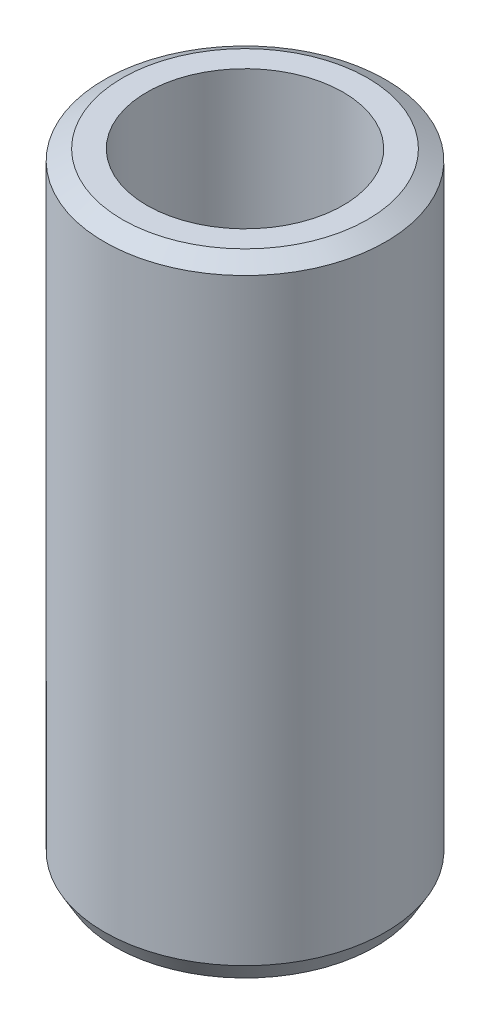
ISO-10303-21;
HEADER;
FILE_DESCRIPTION(('STEP AP214'),'2;1');
FILE_NAME('part.step','',(''),(''),'','','');
FILE_SCHEMA(('AUTOMOTIVE_DESIGN { 1 0 10303 214 1 1 1 1 }'));
ENDSEC;
DATA;
#1=APPLICATION_CONTEXT('core data for automotive mechanical design processes');
#2=APPLICATION_PROTOCOL_DEFINITION('international standard','automotive_design',2000,#1);
#3=PRODUCT_CONTEXT('',#1,'mechanical');
#4=PRODUCT('Part','Part','',(#3));
#5=PRODUCT_RELATED_PRODUCT_CATEGORY('part','',(#4));
#6=PRODUCT_DEFINITION_FORMATION('','',#4);
#7=PRODUCT_DEFINITION_CONTEXT('part definition',#1,'design');
#8=PRODUCT_DEFINITION('design','',#6,#7);
#9=PRODUCT_DEFINITION_SHAPE('','',#8);
#10=(LENGTH_UNIT() NAMED_UNIT(*) SI_UNIT(.MILLI.,.METRE.));
#11=(NAMED_UNIT(*) PLANE_ANGLE_UNIT() SI_UNIT($,.RADIAN.));
#12=(NAMED_UNIT(*) SI_UNIT($,.STERADIAN.) SOLID_ANGLE_UNIT());
#13=UNCERTAINTY_MEASURE_WITH_UNIT(LENGTH_MEASURE(1.E-05),#10,'distance_accuracy_value','');
#14=(GEOMETRIC_REPRESENTATION_CONTEXT(3) GLOBAL_UNCERTAINTY_ASSIGNED_CONTEXT((#13)) GLOBAL_UNIT_ASSIGNED_CONTEXT((#10,
#11,#12)) REPRESENTATION_CONTEXT('',''));
#15=CARTESIAN_POINT('',(0.,0.,0.));
#16=DIRECTION('',(0.,0.,1.));
#17=DIRECTION('',(1.,0.,0.));
#18=AXIS2_PLACEMENT_3D('',#15,#16,#17);
#19=CARTESIAN_POINT('',(0.,244.865349335781,0.));
#20=DIRECTION('',(0.,-1.,0.));
#21=DIRECTION('',(0.,0.,-1.));
#22=AXIS2_PLACEMENT_3D('',#19,#20,#21);
#23=CYLINDRICAL_SURFACE('',#22,55.);
#24=CARTESIAN_POINT('',(0.,240.804430638492,0.));
#25=DIRECTION('',(0.,1.,0.));
#26=DIRECTION('',(0.,0.,1.));
#27=AXIS2_PLACEMENT_3D('',#24,#25,#26);
#28=CIRCLE('',#27,55.);
#29=CARTESIAN_POINT('',(0.,240.804430638492,-55.));
#30=VERTEX_POINT('',#29);
#31=EDGE_CURVE('E50',#30,#30,#28,.F.);
#32=CARTESIAN_POINT('',(0.,7.03371750911244,0.));
#33=DIRECTION('',(0.,1.,0.));
#34=DIRECTION('',(0.,0.,1.));
#35=AXIS2_PLACEMENT_3D('',#32,#33,#34);
#36=CIRCLE('',#35,55.);
#37=CARTESIAN_POINT('',(0.,7.03371750911241,-55.));
#38=VERTEX_POINT('',#37);
#39=EDGE_CURVE('E51',#38,#38,#36,.T.);
#40=CARTESIAN_POINT('',(0.,240.804430638492,-55.));
#41=CARTESIAN_POINT('',(0.,238.369319043394,-55.));
#42=CARTESIAN_POINT('',(0.,235.934207448296,-55.));
#43=CARTESIAN_POINT('',(0.,231.063984258101,-55.));
#44=CARTESIAN_POINT('',(0.,228.628872663003,-55.));
#45=CARTESIAN_POINT('',(0.,223.758649472808,-55.));
#46=CARTESIAN_POINT('',(0.,221.32353787771,-55.));
#47=CARTESIAN_POINT('',(0.,216.453314687515,-55.));
#48=CARTESIAN_POINT('',(0.,214.018203092417,-55.));
#49=CARTESIAN_POINT('',(0.,209.147979902221,-55.));
#50=CARTESIAN_POINT('',(0.,206.712868307124,-55.));
#51=CARTESIAN_POINT('',(0.,201.842645116928,-55.));
#52=CARTESIAN_POINT('',(0.,199.407533521831,-55.));
#53=CARTESIAN_POINT('',(0.,194.537310331635,-55.));
#54=CARTESIAN_POINT('',(0.,192.102198736538,-55.));
#55=CARTESIAN_POINT('',(0.,187.231975546342,-55.));
#56=CARTESIAN_POINT('',(0.,184.796863951244,-55.));
#57=CARTESIAN_POINT('',(0.,179.926640761049,-55.));
#58=CARTESIAN_POINT('',(0.,177.491529165951,-55.));
#59=CARTESIAN_POINT('',(0.,172.621305975756,-55.));
#60=CARTESIAN_POINT('',(0.,170.186194380658,-55.));
#61=CARTESIAN_POINT('',(0.,165.315971190463,-55.));
#62=CARTESIAN_POINT('',(0.,162.880859595365,-55.));
#63=CARTESIAN_POINT('',(0.,158.01063640517,-55.));
#64=CARTESIAN_POINT('',(0.,155.575524810072,-55.));
#65=CARTESIAN_POINT('',(0.,150.705301619877,-55.));
#66=CARTESIAN_POINT('',(0.,148.270190024779,-55.));
#67=CARTESIAN_POINT('',(0.,143.399966834584,-55.));
#68=CARTESIAN_POINT('',(0.,140.964855239486,-55.));
#69=CARTESIAN_POINT('',(0.,136.09463204929,-55.));
#70=CARTESIAN_POINT('',(0.,133.659520454193,-55.));
#71=CARTESIAN_POINT('',(0.,128.789297263997,-55.));
#72=CARTESIAN_POINT('',(0.,126.3541856689,-55.));
#73=CARTESIAN_POINT('',(0.,121.483962478704,-55.));
#74=CARTESIAN_POINT('',(0.,119.048850883607,-55.));
#75=CARTESIAN_POINT('',(0.,114.178627693411,-55.));
#76=CARTESIAN_POINT('',(0.,111.743516098313,-55.));
#77=CARTESIAN_POINT('',(0.,106.873292908118,-55.));
#78=CARTESIAN_POINT('',(0.,104.43818131302,-55.));
#79=CARTESIAN_POINT('',(0.,99.567958122825,-55.));
#80=CARTESIAN_POINT('',(0.,97.1328465277273,-55.));
#81=CARTESIAN_POINT('',(0.,92.2626233375319,-55.));
#82=CARTESIAN_POINT('',(0.,89.8275117424342,-55.));
#83=CARTESIAN_POINT('',(0.,84.9572885522388,-55.));
#84=CARTESIAN_POINT('',(0.,82.5221769571411,-55.));
#85=CARTESIAN_POINT('',(0.,77.6519537669457,-55.));
#86=CARTESIAN_POINT('',(0.,75.216842171848,-55.));
#87=CARTESIAN_POINT('',(0.,70.3466189816526,-55.));
#88=CARTESIAN_POINT('',(0.,67.9115073865549,-55.));
#89=CARTESIAN_POINT('',(0.,63.0412841963595,-55.));
#90=CARTESIAN_POINT('',(0.,60.6061726012618,-55.));
#91=CARTESIAN_POINT('',(0.,55.7359494110664,-55.));
#92=CARTESIAN_POINT('',(0.,53.3008378159687,-55.));
#93=CARTESIAN_POINT('',(0.,48.4306146257733,-55.));
#94=CARTESIAN_POINT('',(0.,45.9955030306756,-55.));
#95=CARTESIAN_POINT('',(0.,41.1252798404802,-55.));
#96=CARTESIAN_POINT('',(0.,38.6901682453825,-55.));
#97=CARTESIAN_POINT('',(0.,33.8199450551871,-55.));
#98=CARTESIAN_POINT('',(0.,31.3848334600894,-55.));
#99=CARTESIAN_POINT('',(0.,26.514610269894,-55.));
#100=CARTESIAN_POINT('',(0.,24.0794986747963,-55.));
#101=CARTESIAN_POINT('',(0.,19.2092754846009,-55.));
#102=CARTESIAN_POINT('',(0.,16.7741638895032,-55.));
#103=CARTESIAN_POINT('',(0.,11.9039406993078,-55.));
#104=CARTESIAN_POINT('',(0.,9.46882910421011,-55.));
#105=CARTESIAN_POINT('',(0.,7.03371750911241,-55.));
#106=B_SPLINE_CURVE_WITH_KNOTS('',3,(#40,#41,#42,#43,#44,#45,#46,#47,#48,#49,#50,#51,#52,#53,
#54,#55,#56,#57,#58,#59,#60,#61,#62,#63,#64,#65,#66,#67,#68,#69,#70,#71,#72,#73,#74,#75,#76,#77,
#78,#79,#80,#81,#82,#83,#84,#85,#86,#87,#88,#89,#90,#91,#92,#93,#94,#95,#96,#97,#98,#99,#100,
#101,#102,#103,#104,#105),.UNSPECIFIED.,.F.,.F.,(4,2,2,2,2,2,2,2,2,2,2,2,2,2,2,2,2,2,2,2,2,2,2,
2,2,2,2,2,2,2,2,2,4),(0.,7.30533478529311,14.6106695705862,21.9160043558793,29.2213391411724,
36.5266739264655,43.8320087117586,51.1373434970517,58.4426782823448,65.7480130676379,
73.053347852931,80.3586826382241,87.6640174235172,94.9693522088103,102.274686994103,
109.580021779396,116.88535656469,124.190691349983,131.496026135276,138.801360920569,
146.106695705862,153.412030491155,160.717365276448,168.022700061741,175.328034847034,
182.633369632327,189.938704417621,197.244039202914,204.549373988207,211.8547087735,
219.160043558793,226.465378344086,233.770713129379),.UNSPECIFIED.);
#107=EDGE_CURVE('BSEAM39',#30,#38,#106,.T.);
#108=ORIENTED_EDGE('',*,*,#31,.T.);
#109=ORIENTED_EDGE('',*,*,#39,.T.);
#110=ORIENTED_EDGE('',*,*,#107,.T.);
#111=ORIENTED_EDGE('',*,*,#107,.F.);
#112=EDGE_LOOP('',(#108,#110,#109,#111));
#113=FACE_BOUND('',#112,.T.);
#114=ADVANCED_FACE('F39',(#113),#23,.T.);
#115=CARTESIAN_POINT('',(0.,244.865349335781,0.));
#116=DIRECTION('',(0.,1.,0.));
#117=DIRECTION('',(0.,0.,1.));
#118=AXIS2_PLACEMENT_3D('',#115,#116,#117);
#119=PLANE('',#118);
#120=CARTESIAN_POINT('',(0.,244.865349335781,0.));
#121=DIRECTION('',(0.,1.,0.));
#122=DIRECTION('',(0.,0.,1.));
#123=AXIS2_PLACEMENT_3D('',#120,#121,#122);
#124=CIRCLE('',#123,47.9662824908881);
#125=CARTESIAN_POINT('',(0.,244.865349335781,47.9662824908881));
#126=VERTEX_POINT('',#125);
#127=EDGE_CURVE('E54',#126,#126,#124,.T.);
#128=ORIENTED_EDGE('',*,*,#127,.T.);
#129=EDGE_LOOP('',(#128));
#130=FACE_BOUND('',#129,.T.);
#131=CARTESIAN_POINT('',(0.,244.865349335781,0.));
#132=DIRECTION('',(0.,1.,0.));
#133=DIRECTION('',(0.,0.,1.));
#134=AXIS2_PLACEMENT_3D('',#131,#132,#133);
#135=CIRCLE('',#134,38.3685747780676);
#136=CARTESIAN_POINT('',(0.,244.865349335781,-38.3685747780676));
#137=VERTEX_POINT('',#136);
#138=EDGE_CURVE('E58',#137,#137,#135,.T.);
#139=ORIENTED_EDGE('',*,*,#138,.F.);
#140=EDGE_LOOP('',(#139));
#141=FACE_BOUND('',#140,.T.);
#142=ADVANCED_FACE('F69',(#130,#141),#119,.T.);
#143=CARTESIAN_POINT('',(0.,0.,0.));
#144=DIRECTION('',(0.,1.,0.));
#145=DIRECTION('',(0.,0.,1.));
#146=AXIS2_PLACEMENT_3D('',#143,#144,#145);
#147=PLANE('',#146);
#148=CARTESIAN_POINT('',(0.,0.,0.));
#149=DIRECTION('',(0.,1.,0.));
#150=DIRECTION('',(0.,0.,1.));
#151=AXIS2_PLACEMENT_3D('',#148,#149,#150);
#152=CIRCLE('',#151,50.9390813027101);
#153=CARTESIAN_POINT('',(0.,0.,50.9390813027101));
#154=VERTEX_POINT('',#153);
#155=EDGE_CURVE('E10',#154,#154,#152,.F.);
#156=ORIENTED_EDGE('',*,*,#155,.T.);
#157=EDGE_LOOP('',(#156));
#158=FACE_BOUND('',#157,.T.);
#159=CARTESIAN_POINT('',(0.,0.,0.));
#160=DIRECTION('',(0.,1.,0.));
#161=DIRECTION('',(0.,0.,1.));
#162=AXIS2_PLACEMENT_3D('',#159,#160,#161);
#163=CIRCLE('',#162,38.3685747780676);
#164=CARTESIAN_POINT('',(0.,0.,-38.3685747780676));
#165=VERTEX_POINT('',#164);
#166=EDGE_CURVE('E63',#165,#165,#163,.T.);
#167=ORIENTED_EDGE('',*,*,#166,.T.);
#168=EDGE_LOOP('',(#167));
#169=FACE_BOUND('',#168,.T.);
#170=ADVANCED_FACE('F75',(#158,#169),#147,.F.);
#171=CARTESIAN_POINT('',(0.,244.865349335781,0.));
#172=DIRECTION('',(0.,-1.,0.));
#173=DIRECTION('',(0.,0.,-1.));
#174=AXIS2_PLACEMENT_3D('',#171,#172,#173);
#175=CYLINDRICAL_SURFACE('',#174,38.3685747780676);
#176=CARTESIAN_POINT('',(0.,244.865349335781,-38.3685747780676));
#177=CARTESIAN_POINT('',(0.,242.314668613533,-38.3685747780676));
#178=CARTESIAN_POINT('',(0.,239.763987891286,-38.3685747780676));
#179=CARTESIAN_POINT('',(0.,234.66262644679,-38.3685747780676));
#180=CARTESIAN_POINT('',(0.,232.111945724542,-38.3685747780676));
#181=CARTESIAN_POINT('',(0.,227.010584280047,-38.3685747780676));
#182=CARTESIAN_POINT('',(0.,224.459903557799,-38.3685747780676));
#183=CARTESIAN_POINT('',(0.,219.358542113304,-38.3685747780676));
#184=CARTESIAN_POINT('',(0.,216.807861391056,-38.3685747780676));
#185=CARTESIAN_POINT('',(0.,211.706499946561,-38.3685747780676));
#186=CARTESIAN_POINT('',(0.,209.155819224313,-38.3685747780676));
#187=CARTESIAN_POINT('',(0.,204.054457779818,-38.3685747780676));
#188=CARTESIAN_POINT('',(0.,201.50377705757,-38.3685747780676));
#189=CARTESIAN_POINT('',(0.,196.402415613074,-38.3685747780676));
#190=CARTESIAN_POINT('',(0.,193.851734890827,-38.3685747780676));
#191=CARTESIAN_POINT('',(0.,188.750373446331,-38.3685747780676));
#192=CARTESIAN_POINT('',(0.,186.199692724083,-38.3685747780676));
#193=CARTESIAN_POINT('',(0.,181.098331279588,-38.3685747780676));
#194=CARTESIAN_POINT('',(0.,178.54765055734,-38.3685747780676));
#195=CARTESIAN_POINT('',(0.,173.446289112845,-38.3685747780676));
#196=CARTESIAN_POINT('',(0.,170.895608390597,-38.3685747780676));
#197=CARTESIAN_POINT('',(0.,165.794246946102,-38.3685747780676));
#198=CARTESIAN_POINT('',(0.,163.243566223854,-38.3685747780676));
#199=CARTESIAN_POINT('',(0.,158.142204779359,-38.3685747780676));
#200=CARTESIAN_POINT('',(0.,155.591524057111,-38.3685747780676));
#201=CARTESIAN_POINT('',(0.,150.490162612615,-38.3685747780676));
#202=CARTESIAN_POINT('',(0.,147.939481890368,-38.3685747780676));
#203=CARTESIAN_POINT('',(0.,142.838120445872,-38.3685747780676));
#204=CARTESIAN_POINT('',(0.,140.287439723625,-38.3685747780676));
#205=CARTESIAN_POINT('',(0.,135.186078279129,-38.3685747780676));
#206=CARTESIAN_POINT('',(0.,132.635397556881,-38.3685747780676));
#207=CARTESIAN_POINT('',(0.,127.534036112386,-38.3685747780676));
#208=CARTESIAN_POINT('',(0.,124.983355390138,-38.3685747780676));
#209=CARTESIAN_POINT('',(0.,119.881993945643,-38.3685747780676));
#210=CARTESIAN_POINT('',(0.,117.331313223395,-38.3685747780676));
#211=CARTESIAN_POINT('',(0.,112.2299517789,-38.3685747780676));
#212=CARTESIAN_POINT('',(0.,109.679271056652,-38.3685747780676));
#213=CARTESIAN_POINT('',(0.,104.577909612157,-38.3685747780676));
#214=CARTESIAN_POINT('',(0.,102.027228889909,-38.3685747780676));
#215=CARTESIAN_POINT('',(0.,96.9258674454133,-38.3685747780676));
#216=CARTESIAN_POINT('',(0.,94.3751867231656,-38.3685747780676));
#217=CARTESIAN_POINT('',(0.,89.2738252786702,-38.3685747780676));
#218=CARTESIAN_POINT('',(0.,86.7231445564225,-38.3685747780676));
#219=CARTESIAN_POINT('',(0.,81.621783111927,-38.3685747780676));
#220=CARTESIAN_POINT('',(0.,79.0711023896793,-38.3685747780676));
#221=CARTESIAN_POINT('',(0.,73.9697409451839,-38.3685747780676));
#222=CARTESIAN_POINT('',(0.,71.4190602229361,-38.3685747780676));
#223=CARTESIAN_POINT('',(0.,66.3176987784407,-38.3685747780676));
#224=CARTESIAN_POINT('',(0.,63.767018056193,-38.3685747780676));
#225=CARTESIAN_POINT('',(0.,58.6656566116976,-38.3685747780676));
#226=CARTESIAN_POINT('',(0.,56.1149758894498,-38.3685747780676));
#227=CARTESIAN_POINT('',(0.,51.0136144449544,-38.3685747780676));
#228=CARTESIAN_POINT('',(0.,48.4629337227067,-38.3685747780676));
#229=CARTESIAN_POINT('',(0.,43.3615722782112,-38.3685747780676));
#230=CARTESIAN_POINT('',(0.,40.8108915559635,-38.3685747780676));
#231=CARTESIAN_POINT('',(0.,35.7095301114681,-38.3685747780676));
#232=CARTESIAN_POINT('',(0.,33.1588493892204,-38.3685747780676));
#233=CARTESIAN_POINT('',(0.,28.0574879447249,-38.3685747780676));
#234=CARTESIAN_POINT('',(0.,25.5068072224772,-38.3685747780676));
#235=CARTESIAN_POINT('',(0.,20.4054457779818,-38.3685747780676));
#236=CARTESIAN_POINT('',(0.,17.854765055734,-38.3685747780676));
#237=CARTESIAN_POINT('',(0.,12.7534036112386,-38.3685747780676));
#238=CARTESIAN_POINT('',(0.,10.2027228889909,-38.3685747780676));
#239=CARTESIAN_POINT('',(0.,5.10136144449543,-38.3685747780676));
#240=CARTESIAN_POINT('',(0.,2.55068072224772,-38.3685747780676));
#241=CARTESIAN_POINT('',(0.,0.,-38.3685747780676));
#242=B_SPLINE_CURVE_WITH_KNOTS('',3,(#176,#177,#178,#179,#180,#181,#182,#183,#184,#185,#186,
#187,#188,#189,#190,#191,#192,#193,#194,#195,#196,#197,#198,#199,#200,#201,#202,#203,#204,#205,
#206,#207,#208,#209,#210,#211,#212,#213,#214,#215,#216,#217,#218,#219,#220,#221,#222,#223,#224,
#225,#226,#227,#228,#229,#230,#231,#232,#233,#234,#235,#236,#237,#238,#239,#240,#241),
.UNSPECIFIED.,.F.,.F.,(4,2,2,2,2,2,2,2,2,2,2,2,2,2,2,2,2,2,2,2,2,2,2,2,2,2,2,2,2,2,2,2,4),(0.,
7.65204216674317,15.3040843334863,22.9561265002295,30.6081686669726,38.2602108337158,
45.912253000459,53.5642951672021,61.2163373339453,68.8683795006884,76.5204216674316,
84.1724638341747,91.8245060009179,99.4765481676611,107.128590334404,114.780632501147,
122.432674667891,130.084716834634,137.736759001377,145.38880116812,153.040843334863,
160.692885501606,168.344927668349,175.996969835093,183.649012001836,191.301054168579,
198.953096335322,206.605138502065,214.257180668808,221.909222835552,229.561265002295,
237.213307169038,244.865349335781),.UNSPECIFIED.);
#243=EDGE_CURVE('BSEAM70',#137,#165,#242,.T.);
#244=ORIENTED_EDGE('',*,*,#138,.T.);
#245=ORIENTED_EDGE('',*,*,#166,.F.);
#246=ORIENTED_EDGE('',*,*,#243,.T.);
#247=ORIENTED_EDGE('',*,*,#243,.F.);
#248=EDGE_LOOP('',(#244,#246,#245,#247));
#249=FACE_BOUND('',#248,.T.);
#250=ADVANCED_FACE('F70',(#249),#175,.F.);
#251=CARTESIAN_POINT('',(0.,244.865349335781,0.));
#252=DIRECTION('',(0.,-1.,0.));
#253=DIRECTION('',(0.,0.,-1.));
#254=AXIS2_PLACEMENT_3D('',#251,#252,#253);
#255=CONICAL_SURFACE('',#254,47.9662824908881,1.0471975511966);
#256=ORIENTED_EDGE('',*,*,#31,.F.);
#257=EDGE_LOOP('',(#256));
#258=FACE_BOUND('',#257,.T.);
#259=ORIENTED_EDGE('',*,*,#127,.F.);
#260=EDGE_LOOP('',(#259));
#261=FACE_BOUND('',#260,.T.);
#262=ADVANCED_FACE('F81',(#258,#261),#255,.T.);
#263=CARTESIAN_POINT('',(0.,7.03371750911244,0.));
#264=DIRECTION('',(0.,1.,0.));
#265=DIRECTION('',(0.,0.,1.));
#266=AXIS2_PLACEMENT_3D('',#263,#264,#265);
#267=CONICAL_SURFACE('',#266,55.,0.523598775598303);
#268=ORIENTED_EDGE('',*,*,#155,.F.);
#269=EDGE_LOOP('',(#268));
#270=FACE_BOUND('',#269,.T.);
#271=ORIENTED_EDGE('',*,*,#39,.F.);
#272=EDGE_LOOP('',(#271));
#273=FACE_BOUND('',#272,.T.);
#274=ADVANCED_FACE('F45',(#270,#273),#267,.T.);
#275=CLOSED_SHELL('',(#114,#142,#170,#250,#262,#274));
#276=MANIFOLD_SOLID_BREP('B2',#275);
#277=ADVANCED_BREP_SHAPE_REPRESENTATION('',(#18,#276),#14);
#278=SHAPE_DEFINITION_REPRESENTATION(#9,#277);
ENDSEC;
END-ISO-10303-21;
